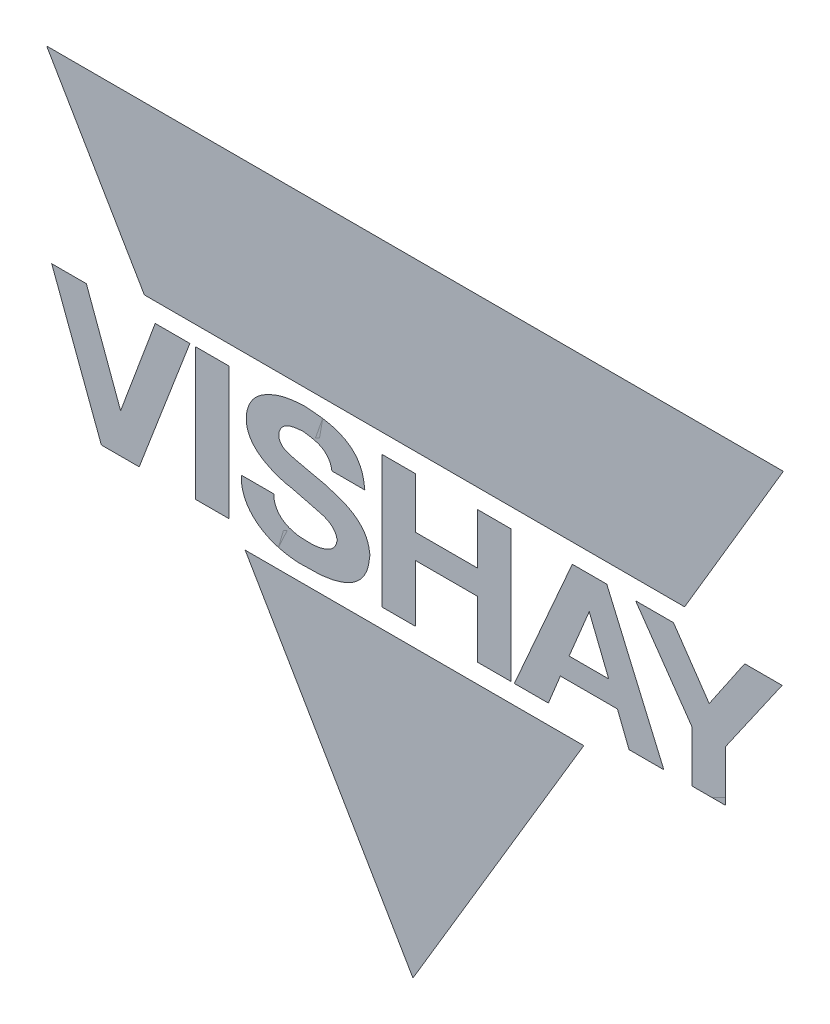
ISO-10303-21;
HEADER;
FILE_DESCRIPTION(('STEP AP214'),'2;1');
FILE_NAME('part.step','',(''),(''),'','','');
FILE_SCHEMA(('AUTOMOTIVE_DESIGN { 1 0 10303 214 1 1 1 1 }'));
ENDSEC;
DATA;
#1=APPLICATION_CONTEXT('core data for automotive mechanical design processes');
#2=APPLICATION_PROTOCOL_DEFINITION('international standard','automotive_design',2000,#1);
#3=PRODUCT_CONTEXT('',#1,'mechanical');
#4=PRODUCT('Part','Part','',(#3));
#5=PRODUCT_RELATED_PRODUCT_CATEGORY('part','',(#4));
#6=PRODUCT_DEFINITION_FORMATION('','',#4);
#7=PRODUCT_DEFINITION_CONTEXT('part definition',#1,'design');
#8=PRODUCT_DEFINITION('design','',#6,#7);
#9=PRODUCT_DEFINITION_SHAPE('','',#8);
#10=(LENGTH_UNIT() NAMED_UNIT(*) SI_UNIT(.MILLI.,.METRE.));
#11=(NAMED_UNIT(*) PLANE_ANGLE_UNIT() SI_UNIT($,.RADIAN.));
#12=(NAMED_UNIT(*) SI_UNIT($,.STERADIAN.) SOLID_ANGLE_UNIT());
#13=UNCERTAINTY_MEASURE_WITH_UNIT(LENGTH_MEASURE(1.E-05),#10,'distance_accuracy_value','');
#14=(GEOMETRIC_REPRESENTATION_CONTEXT(3) GLOBAL_UNCERTAINTY_ASSIGNED_CONTEXT((#13)) GLOBAL_UNIT_ASSIGNED_CONTEXT((#10,
#11,#12)) REPRESENTATION_CONTEXT('',''));
#15=CARTESIAN_POINT('',(0.,0.,0.));
#16=DIRECTION('',(0.,0.,1.));
#17=DIRECTION('',(1.,0.,0.));
#18=AXIS2_PLACEMENT_3D('',#15,#16,#17);
#19=CARTESIAN_POINT('',(-0.02640987644903,0.773280378382,0.00045));
#20=DIRECTION('',(0.,0.,1.));
#21=DIRECTION('',(1.,0.,0.));
#22=AXIS2_PLACEMENT_3D('',#19,#20,#21);
#23=PLANE('',#22);
#24=CARTESIAN_POINT('',(-0.00799584164895,0.821839304632,0.00045));
#25=DIRECTION('',(-1.,0.,0.));
#26=VECTOR('',#25,1.);
#27=LINE('',#24,#26);
#28=CARTESIAN_POINT('',(-0.00799584164895,0.821839304632,0.000225));
#29=VERTEX_POINT('',#28);
#30=CARTESIAN_POINT('',(-0.04483000724903,0.821839304632,0.000225));
#31=VERTEX_POINT('',#30);
#32=EDGE_CURVE('P0_E182',#29,#31,#27,.T.);
#33=ORIENTED_EDGE('',*,*,#32,.T.);
#34=CARTESIAN_POINT('',(-0.04483000724903,0.821839304632,0.00045));
#35=DIRECTION('',(0.,1.,0.));
#36=VECTOR('',#35,1.);
#37=LINE('',#34,#36);
#38=CARTESIAN_POINT('',(-0.04483000724903,0.852070542747,0.000225));
#39=VERTEX_POINT('',#38);
#40=EDGE_CURVE('P0_E28',#31,#39,#37,.T.);
#41=ORIENTED_EDGE('',*,*,#40,.T.);
#42=CARTESIAN_POINT('',(-0.04483000724903,0.852070542747,0.00045));
#43=DIRECTION('',(-1.,0.,0.));
#44=VECTOR('',#43,1.);
#45=LINE('',#42,#44);
#46=CARTESIAN_POINT('',(-0.064835853699,0.852070542747,0.000225));
#47=VERTEX_POINT('',#46);
#48=EDGE_CURVE('P0_E11',#39,#47,#45,.T.);
#49=ORIENTED_EDGE('',*,*,#48,.T.);
#50=CARTESIAN_POINT('',(-0.064835853699,0.852070542747,0.00045));
#51=DIRECTION('',(0.,-1.,0.));
#52=VECTOR('',#51,1.);
#53=LINE('',#50,#52);
#54=CARTESIAN_POINT('',(-0.064835853699,0.773280378382,0.000225));
#55=VERTEX_POINT('',#54);
#56=EDGE_CURVE('P0_E68',#47,#55,#53,.T.);
#57=ORIENTED_EDGE('',*,*,#56,.T.);
#58=CARTESIAN_POINT('',(-0.064835853699,0.773280378382,0.00045));
#59=DIRECTION('',(1.,0.,0.));
#60=VECTOR('',#59,1.);
#61=LINE('',#58,#60);
#62=CARTESIAN_POINT('',(-0.04483000724903,0.773280378382,0.000225));
#63=VERTEX_POINT('',#62);
#64=EDGE_CURVE('P0_E65',#55,#63,#61,.T.);
#65=ORIENTED_EDGE('',*,*,#64,.T.);
#66=CARTESIAN_POINT('',(-0.04483000724903,0.773280378382,0.00045));
#67=DIRECTION('',(0.,1.,0.));
#68=VECTOR('',#67,1.);
#69=LINE('',#66,#68);
#70=CARTESIAN_POINT('',(-0.04483000724903,0.807272235722,0.000225));
#71=VERTEX_POINT('',#70);
#72=EDGE_CURVE('P0_E170',#63,#71,#69,.T.);
#73=ORIENTED_EDGE('',*,*,#72,.T.);
#74=CARTESIAN_POINT('',(-0.04483000724903,0.807272235722,0.00045));
#75=DIRECTION('',(1.,0.,0.));
#76=VECTOR('',#75,1.);
#77=LINE('',#74,#76);
#78=CARTESIAN_POINT('',(-0.00799584164895,0.807272235722,0.000225));
#79=VERTEX_POINT('',#78);
#80=EDGE_CURVE('P0_E171',#71,#79,#77,.T.);
#81=ORIENTED_EDGE('',*,*,#80,.T.);
#82=CARTESIAN_POINT('',(-0.00799584164895,0.807272235722,0.00045));
#83=DIRECTION('',(0.,-1.,0.));
#84=VECTOR('',#83,1.);
#85=LINE('',#82,#84);
#86=CARTESIAN_POINT('',(-0.00799584164895,0.773280378382,0.000225));
#87=VERTEX_POINT('',#86);
#88=EDGE_CURVE('P0_E172',#79,#87,#85,.T.);
#89=ORIENTED_EDGE('',*,*,#88,.T.);
#90=CARTESIAN_POINT('',(-0.00799584164895,0.773280378382,0.00045));
#91=DIRECTION('',(1.,0.,0.));
#92=VECTOR('',#91,1.);
#93=LINE('',#90,#92);
#94=CARTESIAN_POINT('',(0.01201610080095,0.773280378382,0.000225));
#95=VERTEX_POINT('',#94);
#96=EDGE_CURVE('P0_E174',#87,#95,#93,.T.);
#97=ORIENTED_EDGE('',*,*,#96,.T.);
#98=CARTESIAN_POINT('',(0.01201610080095,0.773280378382,0.00045));
#99=DIRECTION('',(0.,1.,0.));
#100=VECTOR('',#99,1.);
#101=LINE('',#98,#100);
#102=CARTESIAN_POINT('',(0.01201610080095,0.852070542747,0.000225));
#103=VERTEX_POINT('',#102);
#104=EDGE_CURVE('P0_E176',#95,#103,#101,.T.);
#105=ORIENTED_EDGE('',*,*,#104,.T.);
#106=CARTESIAN_POINT('',(0.01201610080095,0.852070542747,0.00045));
#107=DIRECTION('',(-1.,0.,0.));
#108=VECTOR('',#107,1.);
#109=LINE('',#106,#108);
#110=CARTESIAN_POINT('',(-0.00799584164895,0.852070542747,0.000225));
#111=VERTEX_POINT('',#110);
#112=EDGE_CURVE('P0_E178',#103,#111,#109,.T.);
#113=ORIENTED_EDGE('',*,*,#112,.T.);
#114=CARTESIAN_POINT('',(-0.00799584164895,0.852070542747,0.00045));
#115=DIRECTION('',(0.,-1.,0.));
#116=VECTOR('',#115,1.);
#117=LINE('',#114,#116);
#118=EDGE_CURVE('P0_E180',#111,#29,#117,.T.);
#119=ORIENTED_EDGE('',*,*,#118,.T.);
#120=EDGE_LOOP('',(#33,#41,#49,#57,#65,#73,#81,#89,#97,#105,#113,#119));
#121=FACE_BOUND('',#120,.T.);
#122=ADVANCED_FACE('P0_F17',(#121),#23,.T.);
#123=CARTESIAN_POINT('',(-0.02640987644903,0.773280378382,0.));
#124=DIRECTION('',(0.,0.,1.));
#125=DIRECTION('',(1.,0.,0.));
#126=AXIS2_PLACEMENT_3D('',#123,#124,#125);
#127=PLANE('',#126);
#128=ORIENTED_EDGE('',*,*,#40,.F.);
#129=ORIENTED_EDGE('',*,*,#32,.F.);
#130=ORIENTED_EDGE('',*,*,#118,.F.);
#131=ORIENTED_EDGE('',*,*,#112,.F.);
#132=ORIENTED_EDGE('',*,*,#104,.F.);
#133=ORIENTED_EDGE('',*,*,#96,.F.);
#134=ORIENTED_EDGE('',*,*,#88,.F.);
#135=ORIENTED_EDGE('',*,*,#80,.F.);
#136=ORIENTED_EDGE('',*,*,#72,.F.);
#137=ORIENTED_EDGE('',*,*,#64,.F.);
#138=ORIENTED_EDGE('',*,*,#56,.F.);
#139=ORIENTED_EDGE('',*,*,#48,.F.);
#140=EDGE_LOOP('',(#128,#129,#130,#131,#132,#133,#134,#135,#136,#137,#138,#139));
#141=FACE_BOUND('',#140,.T.);
#142=ADVANCED_FACE('P0_F70',(#141),#127,.F.);
#143=CLOSED_SHELL('',(#122,#142));
#144=MANIFOLD_SOLID_BREP('P0_B1',#143);
#145=CARTESIAN_POINT('',(-0.110404161724,0.771405147182,0.00045));
#146=DIRECTION('',(0.,0.,1.));
#147=DIRECTION('',(1.,0.,0.));
#148=AXIS2_PLACEMENT_3D('',#145,#146,#147);
#149=PLANE('',#148);
#150=CARTESIAN_POINT('',(-0.118370335149,0.807719203332,0.00045));
#151=CARTESIAN_POINT('',(-0.102137735696251,0.803973408793768,0.00045));
#152=CARTESIAN_POINT('',(-0.099843290192775,0.80323429342325,0.00045));
#153=CARTESIAN_POINT('',(-0.092115900013415,0.800745050228369,0.00045));
#154=CARTESIAN_POINT('',(-0.09135319969905,0.794696203597,0.00045));
#155=B_SPLINE_CURVE_WITH_KNOTS('',2,(#150,#151,#152,#153,#154),.UNSPECIFIED.,.F.,.F.,(3,2,3),
(0.,0.5,1.),.UNSPECIFIED.);
#156=CARTESIAN_POINT('',(-0.118370335149,0.807719203332,0.000225));
#157=VERTEX_POINT('',#156);
#158=CARTESIAN_POINT('',(-0.09135319969905,0.794696203597,0.000225));
#159=VERTEX_POINT('',#158);
#160=EDGE_CURVE('P1_E194',#157,#159,#155,.T.);
#161=ORIENTED_EDGE('',*,*,#160,.T.);
#162=CARTESIAN_POINT('',(-0.09135319969905,0.794696203597,0.00045));
#163=CARTESIAN_POINT('',(-0.0923323395751359,0.785198670603582,0.00045));
#164=CARTESIAN_POINT('',(-0.109067324799,0.784871051035,0.00045));
#165=B_SPLINE_CURVE_WITH_KNOTS('',2,(#162,#163,#164),.UNSPECIFIED.,.F.,.F.,(3,3),(0.,1.),.UNSPECIFIED.);
#166=CARTESIAN_POINT('',(-0.109067324799,0.784871051035,0.000225));
#167=VERTEX_POINT('',#166);
#168=EDGE_CURVE('P1_E28',#159,#167,#165,.T.);
#169=ORIENTED_EDGE('',*,*,#168,.T.);
#170=CARTESIAN_POINT('',(-0.109067324799,0.784871051035,0.00045));
#171=CARTESIAN_POINT('',(-0.128229526417618,0.785438130914285,0.00045));
#172=CARTESIAN_POINT('',(-0.129207257849,0.799429992707,0.00045));
#173=B_SPLINE_CURVE_WITH_KNOTS('',2,(#170,#171,#172),.UNSPECIFIED.,.F.,.F.,(3,3),(0.,1.),.UNSPECIFIED.);
#174=CARTESIAN_POINT('',(-0.129207257849,0.799429992707,0.000225));
#175=VERTEX_POINT('',#174);
#176=EDGE_CURVE('P1_E11',#167,#175,#173,.T.);
#177=ORIENTED_EDGE('',*,*,#176,.T.);
#178=CARTESIAN_POINT('',(-0.129207257849,0.799429992707,0.00045));
#179=DIRECTION('',(-1.,0.,0.));
#180=VECTOR('',#179,1.);
#181=LINE('',#178,#180);
#182=CARTESIAN_POINT('',(-0.148579221899,0.799429992707,0.000225));
#183=VERTEX_POINT('',#182);
#184=EDGE_CURVE('P1_E74',#175,#183,#181,.T.);
#185=ORIENTED_EDGE('',*,*,#184,.T.);
#186=CARTESIAN_POINT('',(-0.148579221899,0.799429992707,0.00045));
#187=CARTESIAN_POINT('',(-0.148480449426062,0.785807413250935,0.00045));
#188=CARTESIAN_POINT('',(-0.1368542088365,0.778137083283125,0.00045));
#189=CARTESIAN_POINT('',(-0.126650331158003,0.771405147182,0.00045));
#190=CARTESIAN_POINT('',(-0.109835293799,0.771405147182,0.00045));
#191=B_SPLINE_CURVE_WITH_KNOTS('',2,(#186,#187,#188,#189,#190),.UNSPECIFIED.,.F.,.F.,(3,2,3),
(0.,0.5,1.),.UNSPECIFIED.);
#192=CARTESIAN_POINT('',(-0.109835293799,0.771405147182,0.000225));
#193=VERTEX_POINT('',#192);
#194=EDGE_CURVE('P1_E71',#183,#193,#191,.T.);
#195=ORIENTED_EDGE('',*,*,#194,.T.);
#196=CARTESIAN_POINT('',(-0.109835293799,0.771405147182,0.00045));
#197=CARTESIAN_POINT('',(-0.0725680846491953,0.771405147182,0.00045));
#198=CARTESIAN_POINT('',(-0.07197513964905,0.796687239112,0.00045));
#199=B_SPLINE_CURVE_WITH_KNOTS('',2,(#196,#197,#198),.UNSPECIFIED.,.F.,.F.,(3,3),(0.,1.),.UNSPECIFIED.);
#200=CARTESIAN_POINT('',(-0.07197513964905,0.796687239112,0.000225));
#201=VERTEX_POINT('',#200);
#202=EDGE_CURVE('P1_E107',#193,#201,#199,.T.);
#203=ORIENTED_EDGE('',*,*,#202,.T.);
#204=CARTESIAN_POINT('',(-0.07197513964905,0.796687239112,0.00045));
#205=CARTESIAN_POINT('',(-0.0723843848430527,0.813913629320581,0.00045));
#206=CARTESIAN_POINT('',(-0.098998371099,0.819624784677,0.00045));
#207=B_SPLINE_CURVE_WITH_KNOTS('',2,(#204,#205,#206),.UNSPECIFIED.,.F.,.F.,(3,3),(0.,1.),.UNSPECIFIED.);
#208=CARTESIAN_POINT('',(-0.098998371099,0.819624784677,0.000225));
#209=VERTEX_POINT('',#208);
#210=EDGE_CURVE('P1_E118',#201,#209,#207,.T.);
#211=ORIENTED_EDGE('',*,*,#210,.T.);
#212=CARTESIAN_POINT('',(-0.098998371099,0.819624784677,0.00045));
#213=CARTESIAN_POINT('',(-0.116307444493554,0.82347775276216,0.00045));
#214=CARTESIAN_POINT('',(-0.12112959826775,0.825214414801375,0.00045));
#215=CARTESIAN_POINT('',(-0.125858642301896,0.826917544075233,0.00045));
#216=CARTESIAN_POINT('',(-0.126147567499,0.831550683482,0.00045));
#217=B_SPLINE_CURVE_WITH_KNOTS('',2,(#212,#213,#214,#215,#216),.UNSPECIFIED.,.F.,.F.,(3,2,3),
(0.,0.5,1.),.UNSPECIFIED.);
#218=CARTESIAN_POINT('',(-0.126147567499,0.831550683482,0.000225));
#219=VERTEX_POINT('',#218);
#220=EDGE_CURVE('P1_E129',#209,#219,#217,.T.);
#221=ORIENTED_EDGE('',*,*,#220,.T.);
#222=CARTESIAN_POINT('',(-0.126147567499,0.831550683482,0.00045));
#223=CARTESIAN_POINT('',(-0.125407845331041,0.840127366447839,0.00045));
#224=CARTESIAN_POINT('',(-0.112385034699,0.840490028062,0.00045));
#225=B_SPLINE_CURVE_WITH_KNOTS('',2,(#222,#223,#224),.UNSPECIFIED.,.F.,.F.,(3,3),(0.,1.),.UNSPECIFIED.);
#226=CARTESIAN_POINT('',(-0.112385034699,0.840490028062,0.000225));
#227=VERTEX_POINT('',#226);
#228=EDGE_CURVE('P1_E140',#219,#227,#225,.T.);
#229=ORIENTED_EDGE('',*,*,#228,.T.);
#230=CARTESIAN_POINT('',(-0.112385034699,0.840490028062,0.00045));
#231=CARTESIAN_POINT('',(-0.0959207399729902,0.840151967192334,0.00045));
#232=CARTESIAN_POINT('',(-0.09441085804905,0.828564129257,0.00045));
#233=B_SPLINE_CURVE_WITH_KNOTS('',2,(#230,#231,#232),.UNSPECIFIED.,.F.,.F.,(3,3),(0.,1.),.UNSPECIFIED.);
#234=CARTESIAN_POINT('',(-0.09441085804905,0.828564129257,0.000225));
#235=VERTEX_POINT('',#234);
#236=EDGE_CURVE('P1_E151',#227,#235,#233,.T.);
#237=ORIENTED_EDGE('',*,*,#236,.T.);
#238=CARTESIAN_POINT('',(-0.09441085804905,0.828564129257,0.00045));
#239=DIRECTION('',(1.,0.,0.));
#240=VECTOR('',#239,1.);
#241=LINE('',#238,#240);
#242=CARTESIAN_POINT('',(-0.07503482999895,0.828564129257,0.000225));
#243=VERTEX_POINT('',#242);
#244=EDGE_CURVE('P1_E212',#235,#243,#241,.T.);
#245=ORIENTED_EDGE('',*,*,#244,.T.);
#246=CARTESIAN_POINT('',(-0.07503482999895,0.828564129257,0.00045));
#247=CARTESIAN_POINT('',(-0.0755423321327005,0.853959997947,0.00045));
#248=CARTESIAN_POINT('',(-0.111491100749,0.853959997947,0.00045));
#249=B_SPLINE_CURVE_WITH_KNOTS('',2,(#246,#247,#248),.UNSPECIFIED.,.F.,.F.,(3,3),(0.,1.),.UNSPECIFIED.);
#250=CARTESIAN_POINT('',(-0.111491100749,0.853959997947,0.000225));
#251=VERTEX_POINT('',#250);
#252=EDGE_CURVE('P1_E163',#243,#251,#249,.T.);
#253=ORIENTED_EDGE('',*,*,#252,.T.);
#254=CARTESIAN_POINT('',(-0.111491100749,0.853959997947,0.00045));
#255=CARTESIAN_POINT('',(-0.124640914999547,0.853959997947,0.00045));
#256=CARTESIAN_POINT('',(-0.13467219564275,0.84807577441575,0.00045));
#257=CARTESIAN_POINT('',(-0.145189128882413,0.841906673156746,0.00045));
#258=CARTESIAN_POINT('',(-0.145521563549,0.830108197797,0.00045));
#259=B_SPLINE_CURVE_WITH_KNOTS('',2,(#254,#255,#256,#257,#258),.UNSPECIFIED.,.F.,.F.,(3,2,3),
(0.,0.5,1.),.UNSPECIFIED.);
#260=CARTESIAN_POINT('',(-0.145521563549,0.830108197797,0.000225));
#261=VERTEX_POINT('',#260);
#262=EDGE_CURVE('P1_E174',#251,#261,#259,.T.);
#263=ORIENTED_EDGE('',*,*,#262,.T.);
#264=CARTESIAN_POINT('',(-0.145521563549,0.830108197797,0.00045));
#265=CARTESIAN_POINT('',(-0.145131871041566,0.813834284962875,0.00045));
#266=CARTESIAN_POINT('',(-0.118370335149,0.807719203332,0.00045));
#267=B_SPLINE_CURVE_WITH_KNOTS('',2,(#264,#265,#266),.UNSPECIFIED.,.F.,.F.,(3,3),(0.,1.),.UNSPECIFIED.);
#268=EDGE_CURVE('P1_E184',#261,#157,#267,.T.);
#269=ORIENTED_EDGE('',*,*,#268,.T.);
#270=EDGE_LOOP('',(#161,#169,#177,#185,#195,#203,#211,#221,#229,#237,#245,#253,#263,#269));
#271=FACE_BOUND('',#270,.T.);
#272=ADVANCED_FACE('P1_F17',(#271),#149,.T.);
#273=CARTESIAN_POINT('',(-0.110404161724,0.771405147182,0.));
#274=DIRECTION('',(0.,0.,1.));
#275=DIRECTION('',(1.,0.,0.));
#276=AXIS2_PLACEMENT_3D('',#273,#274,#275);
#277=PLANE('',#276);
#278=ORIENTED_EDGE('',*,*,#168,.F.);
#279=ORIENTED_EDGE('',*,*,#160,.F.);
#280=ORIENTED_EDGE('',*,*,#268,.F.);
#281=ORIENTED_EDGE('',*,*,#262,.F.);
#282=ORIENTED_EDGE('',*,*,#252,.F.);
#283=ORIENTED_EDGE('',*,*,#244,.F.);
#284=ORIENTED_EDGE('',*,*,#236,.F.);
#285=ORIENTED_EDGE('',*,*,#228,.F.);
#286=ORIENTED_EDGE('',*,*,#220,.F.);
#287=ORIENTED_EDGE('',*,*,#210,.F.);
#288=ORIENTED_EDGE('',*,*,#202,.F.);
#289=ORIENTED_EDGE('',*,*,#194,.F.);
#290=ORIENTED_EDGE('',*,*,#184,.F.);
#291=ORIENTED_EDGE('',*,*,#176,.F.);
#292=EDGE_LOOP('',(#278,#279,#280,#281,#282,#283,#284,#285,#286,#287,#288,#289,#290,#291));
#293=FACE_BOUND('',#292,.T.);
#294=ADVANCED_FACE('P1_F76',(#293),#277,.F.);
#295=CLOSED_SHELL('',(#272,#294));
#296=MANIFOLD_SOLID_BREP('P1_B1',#295);
#297=CARTESIAN_POINT('',(0.129984975226,0.773280378382,0.00045));
#298=DIRECTION('',(0.,0.,1.));
#299=DIRECTION('',(1.,0.,0.));
#300=AXIS2_PLACEMENT_3D('',#297,#298,#299);
#301=PLANE('',#300);
#302=CARTESIAN_POINT('',(0.130177980301,0.820965686872,0.00045));
#303=DIRECTION('',(-0.564857791520084,0.825188266614991,0.));
#304=VECTOR('',#303,1.);
#305=LINE('',#302,#304);
#306=CARTESIAN_POINT('',(0.130177980301,0.820965686872,0.000225));
#307=VERTEX_POINT('',#306);
#308=CARTESIAN_POINT('',(0.108886087401,0.852070542747,0.000225));
#309=VERTEX_POINT('',#308);
#310=EDGE_CURVE('P2_E149',#307,#309,#305,.T.);
#311=ORIENTED_EDGE('',*,*,#310,.T.);
#312=CARTESIAN_POINT('',(0.108886087401,0.852070542747,0.00045));
#313=DIRECTION('',(-1.,0.,0.));
#314=VECTOR('',#313,1.);
#315=LINE('',#312,#314);
#316=CARTESIAN_POINT('',(0.086334564051,0.852070542747,0.000225));
#317=VERTEX_POINT('',#316);
#318=EDGE_CURVE('P2_E28',#309,#317,#315,.T.);
#319=ORIENTED_EDGE('',*,*,#318,.T.);
#320=CARTESIAN_POINT('',(0.086334564051,0.852070542747,0.00045));
#321=DIRECTION('',(0.571460408211035,-0.820629637441445,0.));
#322=VECTOR('',#321,1.);
#323=LINE('',#320,#322);
#324=CARTESIAN_POINT('',(0.119836789401,0.803960614837,0.000225));
#325=VERTEX_POINT('',#324);
#326=EDGE_CURVE('P2_E11',#317,#325,#323,.T.);
#327=ORIENTED_EDGE('',*,*,#326,.T.);
#328=CARTESIAN_POINT('',(0.119836789401,0.803960614837,0.00045));
#329=DIRECTION('',(0.,-1.,0.));
#330=VECTOR('',#329,1.);
#331=LINE('',#328,#330);
#332=CARTESIAN_POINT('',(0.119836789401,0.773280378382,0.000225));
#333=VERTEX_POINT('',#332);
#334=EDGE_CURVE('P2_E59',#325,#333,#331,.T.);
#335=ORIENTED_EDGE('',*,*,#334,.T.);
#336=CARTESIAN_POINT('',(0.119836789401,0.773280378382,0.00045));
#337=DIRECTION('',(1.,0.,0.));
#338=VECTOR('',#337,1.);
#339=LINE('',#336,#338);
#340=CARTESIAN_POINT('',(0.139848725501,0.773280378382,0.000225));
#341=VERTEX_POINT('',#340);
#342=EDGE_CURVE('P2_E56',#333,#341,#339,.T.);
#343=ORIENTED_EDGE('',*,*,#342,.T.);
#344=CARTESIAN_POINT('',(0.139848725501,0.773280378382,0.00045));
#345=DIRECTION('',(0.,1.,0.));
#346=VECTOR('',#345,1.);
#347=LINE('',#344,#346);
#348=CARTESIAN_POINT('',(0.139848725501,0.803513647862,0.000225));
#349=VERTEX_POINT('',#348);
#350=EDGE_CURVE('P2_E143',#341,#349,#347,.T.);
#351=ORIENTED_EDGE('',*,*,#350,.T.);
#352=CARTESIAN_POINT('',(0.139848725501,0.803513647862,0.00045));
#353=DIRECTION('',(0.571155066154539,0.820842183617535,0.));
#354=VECTOR('',#353,1.);
#355=LINE('',#352,#354);
#356=CARTESIAN_POINT('',(0.173635386401,0.852070542747,0.000225));
#357=VERTEX_POINT('',#356);
#358=EDGE_CURVE('P2_E144',#349,#357,#355,.T.);
#359=ORIENTED_EDGE('',*,*,#358,.T.);
#360=CARTESIAN_POINT('',(0.173635386401,0.852070542747,0.00045));
#361=DIRECTION('',(-1.,0.,0.));
#362=VECTOR('',#361,1.);
#363=LINE('',#360,#362);
#364=CARTESIAN_POINT('',(0.151327658601,0.852070542747,0.000225));
#365=VERTEX_POINT('',#364);
#366=EDGE_CURVE('P2_E145',#357,#365,#363,.T.);
#367=ORIENTED_EDGE('',*,*,#366,.T.);
#368=CARTESIAN_POINT('',(0.151327658601,0.852070542747,0.00045));
#369=DIRECTION('',(-0.562280503007886,-0.826946573810666,0.));
#370=VECTOR('',#369,1.);
#371=LINE('',#368,#370);
#372=EDGE_CURVE('P2_E147',#365,#307,#371,.T.);
#373=ORIENTED_EDGE('',*,*,#372,.T.);
#374=EDGE_LOOP('',(#311,#319,#327,#335,#343,#351,#359,#367,#373));
#375=FACE_BOUND('',#374,.T.);
#376=ADVANCED_FACE('P2_F17',(#375),#301,.T.);
#377=CARTESIAN_POINT('',(0.129984975226,0.773280378382,0.));
#378=DIRECTION('',(0.,0.,1.));
#379=DIRECTION('',(1.,0.,0.));
#380=AXIS2_PLACEMENT_3D('',#377,#378,#379);
#381=PLANE('',#380);
#382=ORIENTED_EDGE('',*,*,#318,.F.);
#383=ORIENTED_EDGE('',*,*,#310,.F.);
#384=ORIENTED_EDGE('',*,*,#372,.F.);
#385=ORIENTED_EDGE('',*,*,#366,.F.);
#386=ORIENTED_EDGE('',*,*,#358,.F.);
#387=ORIENTED_EDGE('',*,*,#350,.F.);
#388=ORIENTED_EDGE('',*,*,#342,.F.);
#389=ORIENTED_EDGE('',*,*,#334,.F.);
#390=ORIENTED_EDGE('',*,*,#326,.F.);
#391=EDGE_LOOP('',(#382,#383,#384,#385,#386,#387,#388,#389,#390));
#392=FACE_BOUND('',#391,.T.);
#393=ADVANCED_FACE('P2_F61',(#392),#381,.F.);
#394=CLOSED_SHELL('',(#376,#393));
#395=MANIFOLD_SOLID_BREP('P2_B1',#394);
#396=CARTESIAN_POINT('',(-0.04544922274898,0.591055919997,0.00045));
#397=DIRECTION('',(0.,0.,1.));
#398=DIRECTION('',(1.,0.,0.));
#399=AXIS2_PLACEMENT_3D('',#396,#397,#398);
#400=PLANE('',#399);
#401=CARTESIAN_POINT('',(0.05544346980105,0.761886777217,0.00045));
#402=DIRECTION('',(-1.,0.,0.));
#403=VECTOR('',#402,1.);
#404=LINE('',#401,#403);
#405=CARTESIAN_POINT('',(0.05544346980105,0.761886777217,0.000225));
#406=VERTEX_POINT('',#405);
#407=CARTESIAN_POINT('',(-0.146341915299,0.761886777217,0.000225));
#408=VERTEX_POINT('',#407);
#409=EDGE_CURVE('P3_E39',#406,#408,#404,.T.);
#410=ORIENTED_EDGE('',*,*,#409,.T.);
#411=CARTESIAN_POINT('',(-0.146341915299,0.761886777217,0.00045));
#412=DIRECTION('',(0.505103546373026,-0.863058750863111,0.));
#413=VECTOR('',#412,1.);
#414=LINE('',#411,#413);
#415=CARTESIAN_POINT('',(-0.04636347034902,0.591055919997,0.000225));
#416=VERTEX_POINT('',#415);
#417=EDGE_CURVE('P3_E28',#408,#416,#414,.T.);
#418=ORIENTED_EDGE('',*,*,#417,.T.);
#419=CARTESIAN_POINT('',(-0.04636347034902,0.591055919997,0.00045));
#420=DIRECTION('',(0.511936422084376,0.85902334062786,0.));
#421=VECTOR('',#420,1.);
#422=LINE('',#419,#421);
#423=EDGE_CURVE('P3_E11',#416,#406,#422,.T.);
#424=ORIENTED_EDGE('',*,*,#423,.T.);
#425=EDGE_LOOP('',(#410,#418,#424));
#426=FACE_BOUND('',#425,.T.);
#427=ADVANCED_FACE('P3_F17',(#426),#400,.T.);
#428=CARTESIAN_POINT('',(-0.04544922274898,0.591055919997,0.));
#429=DIRECTION('',(0.,0.,1.));
#430=DIRECTION('',(1.,0.,0.));
#431=AXIS2_PLACEMENT_3D('',#428,#429,#430);
#432=PLANE('',#431);
#433=ORIENTED_EDGE('',*,*,#417,.F.);
#434=ORIENTED_EDGE('',*,*,#409,.F.);
#435=ORIENTED_EDGE('',*,*,#423,.F.);
#436=EDGE_LOOP('',(#433,#434,#435));
#437=FACE_BOUND('',#436,.T.);
#438=ADVANCED_FACE('P3_F41',(#437),#432,.F.);
#439=CLOSED_SHELL('',(#427,#438));
#440=MANIFOLD_SOLID_BREP('P3_B1',#439);
#441=CARTESIAN_POINT('',(0.058612432551,0.773280378382,0.));
#442=DIRECTION('',(0.,0.,1.));
#443=DIRECTION('',(1.,0.,0.));
#444=AXIS2_PLACEMENT_3D('',#441,#442,#443);
#445=PLANE('',#444);
#446=CARTESIAN_POINT('',(0.05880544080105,0.832647784412,0.00045));
#447=DIRECTION('',(0.369024709495312,-0.929419584354613,0.));
#448=VECTOR('',#447,1.);
#449=LINE('',#446,#448);
#450=CARTESIAN_POINT('',(0.058683543026025,0.832647784412,0.000225));
#451=VERTEX_POINT('',#450);
#452=CARTESIAN_POINT('',(0.07028437390095,0.803737131667,0.000225));
#453=VERTEX_POINT('',#452);
#454=EDGE_CURVE('P4_E11',#451,#453,#449,.T.);
#455=ORIENTED_EDGE('',*,*,#454,.F.);
#456=CARTESIAN_POINT('',(0.046696695651,0.803737131667,0.00045));
#457=DIRECTION('',(0.37967053947963,0.925121765742892,0.));
#458=VECTOR('',#457,1.);
#459=LINE('',#456,#458);
#460=CARTESIAN_POINT('',(0.046696695651,0.803737131667,0.000225));
#461=VERTEX_POINT('',#460);
#462=EDGE_CURVE('P4_E28',#461,#451,#459,.T.);
#463=ORIENTED_EDGE('',*,*,#462,.F.);
#464=CARTESIAN_POINT('',(0.07028437390095,0.803737131667,0.00045));
#465=DIRECTION('',(-1.,0.,0.));
#466=VECTOR('',#465,1.);
#467=LINE('',#464,#466);
#468=EDGE_CURVE('P4_E79',#453,#461,#467,.T.);
#469=ORIENTED_EDGE('',*,*,#468,.F.);
#470=EDGE_LOOP('',(#455,#463,#469));
#471=FACE_BOUND('',#470,.T.);
#472=CARTESIAN_POINT('',(0.103156780851,0.773280378382,0.00045));
#473=DIRECTION('',(-0.396508989815125,0.918030838804334,0.));
#474=VECTOR('',#473,1.);
#475=LINE('',#472,#474);
#476=CARTESIAN_POINT('',(0.103156780851,0.773280378382,0.000225));
#477=VERTEX_POINT('',#476);
#478=CARTESIAN_POINT('',(0.06912632440095,0.852070542747,0.000225));
#479=VERTEX_POINT('',#478);
#480=EDGE_CURVE('P4_E68',#477,#479,#475,.T.);
#481=ORIENTED_EDGE('',*,*,#480,.F.);
#482=CARTESIAN_POINT('',(0.08239312540095,0.773280378382,0.00045));
#483=DIRECTION('',(1.,0.,0.));
#484=VECTOR('',#483,1.);
#485=LINE('',#482,#484);
#486=CARTESIAN_POINT('',(0.08239312540095,0.773280378382,0.000225));
#487=VERTEX_POINT('',#486);
#488=EDGE_CURVE('P4_E77',#487,#477,#485,.T.);
#489=ORIENTED_EDGE('',*,*,#488,.F.);
#490=CARTESIAN_POINT('',(0.075505763001,0.790827905517,0.00045));
#491=DIRECTION('',(0.365362421983327,-0.93086535041459,0.));
#492=VECTOR('',#491,1.);
#493=LINE('',#490,#492);
#494=CARTESIAN_POINT('',(0.075505763001,0.790827905517,0.000225));
#495=VERTEX_POINT('',#494);
#496=EDGE_CURVE('P4_E181',#495,#487,#493,.T.);
#497=ORIENTED_EDGE('',*,*,#496,.F.);
#498=CARTESIAN_POINT('',(0.04147530655095,0.790827905517,0.00045));
#499=DIRECTION('',(1.,0.,0.));
#500=VECTOR('',#499,1.);
#501=LINE('',#498,#500);
#502=CARTESIAN_POINT('',(0.04147530655095,0.790827905517,0.000225));
#503=VERTEX_POINT('',#502);
#504=EDGE_CURVE('P4_E179',#503,#495,#501,.T.);
#505=ORIENTED_EDGE('',*,*,#504,.F.);
#506=CARTESIAN_POINT('',(0.03434414860095,0.773280378382,0.00045));
#507=DIRECTION('',(0.376489203734772,0.926421005521333,0.));
#508=VECTOR('',#507,1.);
#509=LINE('',#506,#508);
#510=CARTESIAN_POINT('',(0.03434414860095,0.773280378382,0.000225));
#511=VERTEX_POINT('',#510);
#512=EDGE_CURVE('P4_E178',#511,#503,#509,.T.);
#513=ORIENTED_EDGE('',*,*,#512,.F.);
#514=CARTESIAN_POINT('',(0.014068084251,0.773280378382,0.00045));
#515=DIRECTION('',(1.,0.,0.));
#516=VECTOR('',#515,1.);
#517=LINE('',#514,#516);
#518=CARTESIAN_POINT('',(0.014068084251,0.773280378382,0.000225));
#519=VERTEX_POINT('',#518);
#520=EDGE_CURVE('P4_E176',#519,#511,#517,.T.);
#521=ORIENTED_EDGE('',*,*,#520,.F.);
#522=CARTESIAN_POINT('',(0.04860646450095,0.852070542747,0.00045));
#523=DIRECTION('',(-0.401479093118795,-0.915868187998966,0.));
#524=VECTOR('',#523,1.);
#525=LINE('',#522,#524);
#526=CARTESIAN_POINT('',(0.04860646450095,0.852070542747,0.000225));
#527=VERTEX_POINT('',#526);
#528=EDGE_CURVE('P4_E63',#527,#519,#525,.T.);
#529=ORIENTED_EDGE('',*,*,#528,.F.);
#530=CARTESIAN_POINT('',(0.06912632440095,0.852070542747,0.00045));
#531=DIRECTION('',(-1.,0.,0.));
#532=VECTOR('',#531,1.);
#533=LINE('',#530,#532);
#534=EDGE_CURVE('P4_E66',#479,#527,#533,.T.);
#535=ORIENTED_EDGE('',*,*,#534,.F.);
#536=EDGE_LOOP('',(#481,#489,#497,#505,#513,#521,#529,#535));
#537=FACE_BOUND('',#536,.T.);
#538=ADVANCED_FACE('P4_F17',(#471,#537),#445,.F.);
#539=CARTESIAN_POINT('',(0.058612432551,0.773280378382,0.00045));
#540=DIRECTION('',(0.,0.,1.));
#541=DIRECTION('',(1.,0.,0.));
#542=AXIS2_PLACEMENT_3D('',#539,#540,#541);
#543=PLANE('',#542);
#544=ORIENTED_EDGE('',*,*,#462,.T.);
#545=ORIENTED_EDGE('',*,*,#454,.T.);
#546=ORIENTED_EDGE('',*,*,#468,.T.);
#547=EDGE_LOOP('',(#544,#545,#546));
#548=FACE_BOUND('',#547,.T.);
#549=ORIENTED_EDGE('',*,*,#488,.T.);
#550=ORIENTED_EDGE('',*,*,#480,.T.);
#551=ORIENTED_EDGE('',*,*,#534,.T.);
#552=ORIENTED_EDGE('',*,*,#528,.T.);
#553=ORIENTED_EDGE('',*,*,#520,.T.);
#554=ORIENTED_EDGE('',*,*,#512,.T.);
#555=ORIENTED_EDGE('',*,*,#504,.T.);
#556=ORIENTED_EDGE('',*,*,#496,.T.);
#557=EDGE_LOOP('',(#549,#550,#551,#552,#553,#554,#555,#556));
#558=FACE_BOUND('',#557,.T.);
#559=ADVANCED_FACE('P4_F75',(#548,#558),#543,.T.);
#560=CLOSED_SHELL('',(#538,#559));
#561=MANIFOLD_SOLID_BREP('P4_B1',#560);
#562=CARTESIAN_POINT('',(-0.045141828774,0.863549475847,0.00045));
#563=DIRECTION('',(0.,0.,1.));
#564=DIRECTION('',(1.,0.,0.));
#565=AXIS2_PLACEMENT_3D('',#562,#563,#564);
#566=PLANE('',#565);
#567=CARTESIAN_POINT('',(0.115519930801,0.863549475847,0.00045));
#568=DIRECTION('',(0.509570899852276,0.860428671084211,0.));
#569=VECTOR('',#568,1.);
#570=LINE('',#567,#569);
#571=CARTESIAN_POINT('',(0.115519930801,0.863549475847,0.000225));
#572=VERTEX_POINT('',#571);
#573=CARTESIAN_POINT('',(0.174357075001,0.962898096047,0.000225));
#574=VERTEX_POINT('',#573);
#575=EDGE_CURVE('P5_E41',#572,#574,#570,.T.);
#576=ORIENTED_EDGE('',*,*,#575,.T.);
#577=CARTESIAN_POINT('',(0.174357075001,0.962898096047,0.00045));
#578=DIRECTION('',(-1.,0.,0.));
#579=VECTOR('',#578,1.);
#580=LINE('',#577,#579);
#581=CARTESIAN_POINT('',(-0.264640732549,0.962898096047,0.000225));
#582=VERTEX_POINT('',#581);
#583=EDGE_CURVE('P5_E28',#574,#582,#580,.T.);
#584=ORIENTED_EDGE('',*,*,#583,.T.);
#585=CARTESIAN_POINT('',(-0.264640732549,0.962898096047,0.00045));
#586=DIRECTION('',(0.505626052511722,-0.862752742691331,0.));
#587=VECTOR('',#586,1.);
#588=LINE('',#585,#587);
#589=CARTESIAN_POINT('',(-0.206416344299,0.863549475847,0.000225));
#590=VERTEX_POINT('',#589);
#591=EDGE_CURVE('P5_E11',#582,#590,#588,.T.);
#592=ORIENTED_EDGE('',*,*,#591,.T.);
#593=CARTESIAN_POINT('',(-0.206416344299,0.863549475847,0.00045));
#594=DIRECTION('',(1.,0.,0.));
#595=VECTOR('',#594,1.);
#596=LINE('',#593,#595);
#597=EDGE_CURVE('P5_E44',#590,#572,#596,.T.);
#598=ORIENTED_EDGE('',*,*,#597,.T.);
#599=EDGE_LOOP('',(#576,#584,#592,#598));
#600=FACE_BOUND('',#599,.T.);
#601=ADVANCED_FACE('P5_F17',(#600),#566,.T.);
#602=CARTESIAN_POINT('',(-0.045141828774,0.863549475847,0.));
#603=DIRECTION('',(0.,0.,1.));
#604=DIRECTION('',(1.,0.,0.));
#605=AXIS2_PLACEMENT_3D('',#602,#603,#604);
#606=PLANE('',#605);
#607=ORIENTED_EDGE('',*,*,#583,.F.);
#608=ORIENTED_EDGE('',*,*,#575,.F.);
#609=ORIENTED_EDGE('',*,*,#597,.F.);
#610=ORIENTED_EDGE('',*,*,#591,.F.);
#611=EDGE_LOOP('',(#607,#608,#609,#610));
#612=FACE_BOUND('',#611,.T.);
#613=ADVANCED_FACE('P5_F46',(#612),#606,.F.);
#614=CLOSED_SHELL('',(#601,#613));
#615=MANIFOLD_SOLID_BREP('P5_B1',#614);
#616=CARTESIAN_POINT('',(-0.165974376974,0.773280378382,0.00045));
#617=DIRECTION('',(0.,0.,1.));
#618=DIRECTION('',(1.,0.,0.));
#619=AXIS2_PLACEMENT_3D('',#616,#617,#618);
#620=PLANE('',#619);
#621=CARTESIAN_POINT('',(-0.175976284199,0.773280378382,0.00045));
#622=DIRECTION('',(1.,0.,0.));
#623=VECTOR('',#622,1.);
#624=LINE('',#621,#623);
#625=CARTESIAN_POINT('',(-0.175976284199,0.773280378382,0.000225));
#626=VERTEX_POINT('',#625);
#627=CARTESIAN_POINT('',(-0.155972469749,0.773280378382,0.000225));
#628=VERTEX_POINT('',#627);
#629=EDGE_CURVE('P6_E41',#626,#628,#624,.T.);
#630=ORIENTED_EDGE('',*,*,#629,.T.);
#631=CARTESIAN_POINT('',(-0.155972469749,0.773280378382,0.00045));
#632=DIRECTION('',(0.,1.,0.));
#633=VECTOR('',#632,1.);
#634=LINE('',#631,#633);
#635=CARTESIAN_POINT('',(-0.155972469749,0.852070542747,0.000225));
#636=VERTEX_POINT('',#635);
#637=EDGE_CURVE('P6_E28',#628,#636,#634,.T.);
#638=ORIENTED_EDGE('',*,*,#637,.T.);
#639=CARTESIAN_POINT('',(-0.155972469749,0.852070542747,0.00045));
#640=DIRECTION('',(-1.,0.,0.));
#641=VECTOR('',#640,1.);
#642=LINE('',#639,#641);
#643=CARTESIAN_POINT('',(-0.175976284199,0.852070542747,0.000225));
#644=VERTEX_POINT('',#643);
#645=EDGE_CURVE('P6_E11',#636,#644,#642,.T.);
#646=ORIENTED_EDGE('',*,*,#645,.T.);
#647=CARTESIAN_POINT('',(-0.175976284199,0.852070542747,0.00045));
#648=DIRECTION('',(0.,-1.,0.));
#649=VECTOR('',#648,1.);
#650=LINE('',#647,#649);
#651=EDGE_CURVE('P6_E44',#644,#626,#650,.T.);
#652=ORIENTED_EDGE('',*,*,#651,.T.);
#653=EDGE_LOOP('',(#630,#638,#646,#652));
#654=FACE_BOUND('',#653,.T.);
#655=ADVANCED_FACE('P6_F17',(#654),#620,.T.);
#656=CARTESIAN_POINT('',(-0.165974376974,0.773280378382,0.));
#657=DIRECTION('',(0.,0.,1.));
#658=DIRECTION('',(1.,0.,0.));
#659=AXIS2_PLACEMENT_3D('',#656,#657,#658);
#660=PLANE('',#659);
#661=ORIENTED_EDGE('',*,*,#637,.F.);
#662=ORIENTED_EDGE('',*,*,#629,.F.);
#663=ORIENTED_EDGE('',*,*,#651,.F.);
#664=ORIENTED_EDGE('',*,*,#645,.F.);
#665=EDGE_LOOP('',(#661,#662,#663,#664));
#666=FACE_BOUND('',#665,.T.);
#667=ADVANCED_FACE('P6_F46',(#666),#660,.F.);
#668=CLOSED_SHELL('',(#655,#667));
#669=MANIFOLD_SOLID_BREP('P6_B1',#668);
#670=CARTESIAN_POINT('',(-0.220457650024,0.773280378382,0.00045));
#671=DIRECTION('',(0.,0.,1.));
#672=DIRECTION('',(1.,0.,0.));
#673=AXIS2_PLACEMENT_3D('',#670,#671,#672);
#674=PLANE('',#673);
#675=CARTESIAN_POINT('',(-0.240983602749,0.852070542747,0.00045));
#676=DIRECTION('',(-1.,0.,0.));
#677=VECTOR('',#676,1.);
#678=LINE('',#675,#677);
#679=CARTESIAN_POINT('',(-0.240983602749,0.852070542747,0.000225));
#680=VERTEX_POINT('',#679);
#681=CARTESIAN_POINT('',(-0.261629427599,0.852070542747,0.000225));
#682=VERTEX_POINT('',#681);
#683=EDGE_CURVE('P7_E127',#680,#682,#678,.T.);
#684=ORIENTED_EDGE('',*,*,#683,.T.);
#685=CARTESIAN_POINT('',(-0.261629427599,0.852070542747,0.00045));
#686=DIRECTION('',(0.351380067418283,-0.936232902765718,0.));
#687=VECTOR('',#686,1.);
#688=LINE('',#685,#687);
#689=CARTESIAN_POINT('',(-0.232058480899,0.773280378382,0.000225));
#690=VERTEX_POINT('',#689);
#691=EDGE_CURVE('P7_E28',#682,#690,#688,.T.);
#692=ORIENTED_EDGE('',*,*,#691,.T.);
#693=CARTESIAN_POINT('',(-0.232058480899,0.773280378382,0.00045));
#694=DIRECTION('',(1.,0.,0.));
#695=VECTOR('',#694,1.);
#696=LINE('',#693,#695);
#697=CARTESIAN_POINT('',(-0.209498829549,0.773280378382,0.000225));
#698=VERTEX_POINT('',#697);
#699=EDGE_CURVE('P7_E11',#690,#698,#696,.T.);
#700=ORIENTED_EDGE('',*,*,#699,.T.);
#701=CARTESIAN_POINT('',(-0.209498829549,0.773280378382,0.00045));
#702=DIRECTION('',(0.358039959936834,0.93370626381557,0.));
#703=VECTOR('',#702,1.);
#704=LINE('',#701,#703);
#705=CARTESIAN_POINT('',(-0.179285872449,0.852070542747,0.000225));
#706=VERTEX_POINT('',#705);
#707=EDGE_CURVE('P7_E53',#698,#706,#704,.T.);
#708=ORIENTED_EDGE('',*,*,#707,.T.);
#709=CARTESIAN_POINT('',(-0.179285872449,0.852070542747,0.00045));
#710=DIRECTION('',(-1.,0.,0.));
#711=VECTOR('',#710,1.);
#712=LINE('',#709,#711);
#713=CARTESIAN_POINT('',(-0.199937793299,0.852070542747,0.000225));
#714=VERTEX_POINT('',#713);
#715=EDGE_CURVE('P7_E50',#706,#714,#712,.T.);
#716=ORIENTED_EDGE('',*,*,#715,.T.);
#717=CARTESIAN_POINT('',(-0.199937793299,0.852070542747,0.00045));
#718=DIRECTION('',(-0.347456646230637,-0.937696048296119,0.));
#719=VECTOR('',#718,1.);
#720=LINE('',#717,#719);
#721=CARTESIAN_POINT('',(-0.220586662974,0.796687239112,0.000225));
#722=VERTEX_POINT('',#721);
#723=EDGE_CURVE('P7_E125',#714,#722,#720,.T.);
#724=ORIENTED_EDGE('',*,*,#723,.T.);
#725=CARTESIAN_POINT('',(-0.220713640749,0.796687239112,0.00045));
#726=DIRECTION('',(-0.343697840030351,0.939080291965746,0.));
#727=VECTOR('',#726,1.);
#728=LINE('',#725,#727);
#729=EDGE_CURVE('P7_E126',#722,#680,#728,.T.);
#730=ORIENTED_EDGE('',*,*,#729,.T.);
#731=EDGE_LOOP('',(#684,#692,#700,#708,#716,#724,#730));
#732=FACE_BOUND('',#731,.T.);
#733=ADVANCED_FACE('P7_F17',(#732),#674,.T.);
#734=CARTESIAN_POINT('',(-0.220457650024,0.773280378382,0.));
#735=DIRECTION('',(0.,0.,1.));
#736=DIRECTION('',(1.,0.,0.));
#737=AXIS2_PLACEMENT_3D('',#734,#735,#736);
#738=PLANE('',#737);
#739=ORIENTED_EDGE('',*,*,#691,.F.);
#740=ORIENTED_EDGE('',*,*,#683,.F.);
#741=ORIENTED_EDGE('',*,*,#729,.F.);
#742=ORIENTED_EDGE('',*,*,#723,.F.);
#743=ORIENTED_EDGE('',*,*,#715,.F.);
#744=ORIENTED_EDGE('',*,*,#707,.F.);
#745=ORIENTED_EDGE('',*,*,#699,.F.);
#746=EDGE_LOOP('',(#739,#740,#741,#742,#743,#744,#745));
#747=FACE_BOUND('',#746,.T.);
#748=ADVANCED_FACE('P7_F55',(#747),#738,.F.);
#749=CLOSED_SHELL('',(#733,#748));
#750=MANIFOLD_SOLID_BREP('P7_B1',#749);
#751=ADVANCED_BREP_SHAPE_REPRESENTATION('',(#18,#144,#296,#395,#440,#561,#615,#669,#750),#14);
#752=SHAPE_DEFINITION_REPRESENTATION(#9,#751);
ENDSEC;
END-ISO-10303-21;
